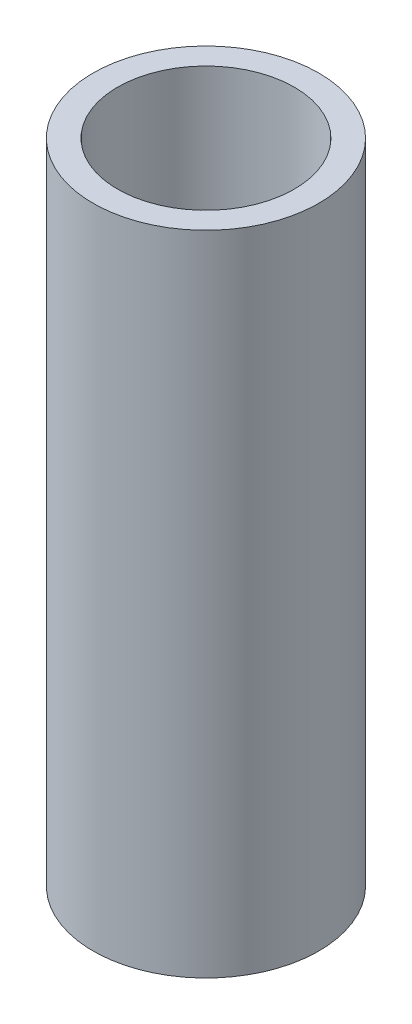
ISO-10303-21;
HEADER;
FILE_DESCRIPTION(('STEP AP214'),'2;1');
FILE_NAME('part.step','',(''),(''),'','','');
FILE_SCHEMA(('AUTOMOTIVE_DESIGN { 1 0 10303 214 1 1 1 1 }'));
ENDSEC;
DATA;
#1=APPLICATION_CONTEXT('core data for automotive mechanical design processes');
#2=APPLICATION_PROTOCOL_DEFINITION('international standard','automotive_design',2000,#1);
#3=PRODUCT_CONTEXT('',#1,'mechanical');
#4=PRODUCT('Part','Part','',(#3));
#5=PRODUCT_RELATED_PRODUCT_CATEGORY('part','',(#4));
#6=PRODUCT_DEFINITION_FORMATION('','',#4);
#7=PRODUCT_DEFINITION_CONTEXT('part definition',#1,'design');
#8=PRODUCT_DEFINITION('design','',#6,#7);
#9=PRODUCT_DEFINITION_SHAPE('','',#8);
#10=(LENGTH_UNIT() NAMED_UNIT(*) SI_UNIT(.MILLI.,.METRE.));
#11=(NAMED_UNIT(*) PLANE_ANGLE_UNIT() SI_UNIT($,.RADIAN.));
#12=(NAMED_UNIT(*) SI_UNIT($,.STERADIAN.) SOLID_ANGLE_UNIT());
#13=UNCERTAINTY_MEASURE_WITH_UNIT(LENGTH_MEASURE(1.E-05),#10,'distance_accuracy_value','');
#14=(GEOMETRIC_REPRESENTATION_CONTEXT(3) GLOBAL_UNCERTAINTY_ASSIGNED_CONTEXT((#13)) GLOBAL_UNIT_ASSIGNED_CONTEXT((#10,
#11,#12)) REPRESENTATION_CONTEXT('',''));
#15=CARTESIAN_POINT('',(0.,0.,0.));
#16=DIRECTION('',(0.,0.,1.));
#17=DIRECTION('',(1.,0.,0.));
#18=AXIS2_PLACEMENT_3D('',#15,#16,#17);
#19=CARTESIAN_POINT('',(0.,172.126797810472,0.));
#20=DIRECTION('',(0.,-1.,0.));
#21=DIRECTION('',(0.,0.,-1.));
#22=AXIS2_PLACEMENT_3D('',#19,#20,#21);
#23=CYLINDRICAL_SURFACE('',#22,30.);
#24=CARTESIAN_POINT('',(0.,172.126797810472,0.));
#25=DIRECTION('',(0.,1.,0.));
#26=DIRECTION('',(0.,0.,1.));
#27=AXIS2_PLACEMENT_3D('',#24,#25,#26);
#28=CIRCLE('',#27,30.);
#29=CARTESIAN_POINT('',(0.,172.126797810472,-30.));
#30=VERTEX_POINT('',#29);
#31=EDGE_CURVE('E10',#30,#30,#28,.T.);
#32=CARTESIAN_POINT('',(0.,0.,0.));
#33=DIRECTION('',(0.,1.,0.));
#34=DIRECTION('',(0.,0.,1.));
#35=AXIS2_PLACEMENT_3D('',#32,#33,#34);
#36=CIRCLE('',#35,30.);
#37=CARTESIAN_POINT('',(0.,0.,-30.));
#38=VERTEX_POINT('',#37);
#39=EDGE_CURVE('E37',#38,#38,#36,.T.);
#40=CARTESIAN_POINT('',(0.,172.126797810472,-30.));
#41=CARTESIAN_POINT('',(0.,170.33381033328,-30.));
#42=CARTESIAN_POINT('',(0.,168.540822856088,-30.));
#43=CARTESIAN_POINT('',(0.,164.954847901703,-30.));
#44=CARTESIAN_POINT('',(0.,163.16186042451,-30.));
#45=CARTESIAN_POINT('',(0.,159.575885470125,-30.));
#46=CARTESIAN_POINT('',(0.,157.782897992933,-30.));
#47=CARTESIAN_POINT('',(0.,154.196923038548,-30.));
#48=CARTESIAN_POINT('',(0.,152.403935561356,-30.));
#49=CARTESIAN_POINT('',(0.,148.817960606971,-30.));
#50=CARTESIAN_POINT('',(0.,147.024973129778,-30.));
#51=CARTESIAN_POINT('',(0.,143.438998175394,-30.));
#52=CARTESIAN_POINT('',(0.,141.646010698201,-30.));
#53=CARTESIAN_POINT('',(0.,138.060035743816,-30.));
#54=CARTESIAN_POINT('',(0.,136.267048266624,-30.));
#55=CARTESIAN_POINT('',(0.,132.681073312239,-30.));
#56=CARTESIAN_POINT('',(0.,130.888085835047,-30.));
#57=CARTESIAN_POINT('',(0.,127.302110880662,-30.));
#58=CARTESIAN_POINT('',(0.,125.509123403469,-30.));
#59=CARTESIAN_POINT('',(0.,121.923148449085,-30.));
#60=CARTESIAN_POINT('',(0.,120.130160971892,-30.));
#61=CARTESIAN_POINT('',(0.,116.544186017507,-30.));
#62=CARTESIAN_POINT('',(0.,114.751198540315,-30.));
#63=CARTESIAN_POINT('',(0.,111.16522358593,-30.));
#64=CARTESIAN_POINT('',(0.,109.372236108738,-30.));
#65=CARTESIAN_POINT('',(0.,105.786261154353,-30.));
#66=CARTESIAN_POINT('',(0.,103.99327367716,-30.));
#67=CARTESIAN_POINT('',(0.,100.407298722776,-30.));
#68=CARTESIAN_POINT('',(0.,98.6143112455831,-30.));
#69=CARTESIAN_POINT('',(0.,95.0283362911983,-30.));
#70=CARTESIAN_POINT('',(0.,93.2353488140059,-30.));
#71=CARTESIAN_POINT('',(0.,89.649373859621,-30.));
#72=CARTESIAN_POINT('',(0.,87.8563863824286,-30.));
#73=CARTESIAN_POINT('',(0.,84.2704114280438,-30.));
#74=CARTESIAN_POINT('',(0.,82.4774239508513,-30.));
#75=CARTESIAN_POINT('',(0.,78.8914489964665,-30.));
#76=CARTESIAN_POINT('',(0.,77.0984615192741,-30.));
#77=CARTESIAN_POINT('',(0.,73.5124865648892,-30.));
#78=CARTESIAN_POINT('',(0.,71.7194990876968,-30.));
#79=CARTESIAN_POINT('',(0.,68.133524133312,-30.));
#80=CARTESIAN_POINT('',(0.,66.3405366561196,-30.));
#81=CARTESIAN_POINT('',(0.,62.7545617017347,-30.));
#82=CARTESIAN_POINT('',(0.,60.9615742245423,-30.));
#83=CARTESIAN_POINT('',(0.,57.3755992701575,-30.));
#84=CARTESIAN_POINT('',(0.,55.582611792965,-30.));
#85=CARTESIAN_POINT('',(0.,51.9966368385802,-30.));
#86=CARTESIAN_POINT('',(0.,50.2036493613878,-30.));
#87=CARTESIAN_POINT('',(0.,46.6176744070029,-30.));
#88=CARTESIAN_POINT('',(0.,44.8246869298105,-30.));
#89=CARTESIAN_POINT('',(0.,41.2387119754257,-30.));
#90=CARTESIAN_POINT('',(0.,39.4457244982332,-30.));
#91=CARTESIAN_POINT('',(0.,35.8597495438484,-30.));
#92=CARTESIAN_POINT('',(0.,34.066762066656,-30.));
#93=CARTESIAN_POINT('',(0.,30.4807871122711,-30.));
#94=CARTESIAN_POINT('',(0.,28.6877996350787,-30.));
#95=CARTESIAN_POINT('',(0.,25.1018246806939,-30.));
#96=CARTESIAN_POINT('',(0.,23.3088372035015,-30.));
#97=CARTESIAN_POINT('',(0.,19.7228622491166,-30.));
#98=CARTESIAN_POINT('',(0.,17.9298747719242,-30.));
#99=CARTESIAN_POINT('',(0.,14.3438998175394,-30.));
#100=CARTESIAN_POINT('',(0.,12.5509123403469,-30.));
#101=CARTESIAN_POINT('',(0.,8.9649373859621,-30.));
#102=CARTESIAN_POINT('',(0.,7.17194990876968,-30.));
#103=CARTESIAN_POINT('',(0.,3.58597495438484,-30.));
#104=CARTESIAN_POINT('',(0.,1.79298747719242,-30.));
#105=CARTESIAN_POINT('',(0.,0.,-30.));
#106=B_SPLINE_CURVE_WITH_KNOTS('',3,(#40,#41,#42,#43,#44,#45,#46,#47,#48,#49,#50,#51,#52,#53,
#54,#55,#56,#57,#58,#59,#60,#61,#62,#63,#64,#65,#66,#67,#68,#69,#70,#71,#72,#73,#74,#75,#76,#77,
#78,#79,#80,#81,#82,#83,#84,#85,#86,#87,#88,#89,#90,#91,#92,#93,#94,#95,#96,#97,#98,#99,#100,
#101,#102,#103,#104,#105),.UNSPECIFIED.,.F.,.F.,(4,2,2,2,2,2,2,2,2,2,2,2,2,2,2,2,2,2,2,2,2,2,2,
2,2,2,2,2,2,2,2,2,4),(0.,5.37896243157726,10.7579248631545,16.1368872947318,21.515849726309,
26.8948121578863,32.2737745894636,37.6527370210408,43.0316994526181,48.4106618841953,
53.7896243157726,59.1685867473499,64.5475491789271,69.9265116105044,75.3054740420816,
80.6844364736589,86.0633989052362,91.4423613368134,96.8213237683907,102.200286199968,
107.579248631545,112.958211063122,118.3371734947,123.716135926277,129.095098357854,
134.474060789432,139.853023221009,145.231985652586,150.610948084163,155.989910515741,
161.368872947318,166.747835378895,172.126797810472),.UNSPECIFIED.);
#107=EDGE_CURVE('BSEAM40',#30,#38,#106,.T.);
#108=ORIENTED_EDGE('',*,*,#31,.F.);
#109=ORIENTED_EDGE('',*,*,#39,.T.);
#110=ORIENTED_EDGE('',*,*,#107,.T.);
#111=ORIENTED_EDGE('',*,*,#107,.F.);
#112=EDGE_LOOP('',(#108,#110,#109,#111));
#113=FACE_BOUND('',#112,.T.);
#114=ADVANCED_FACE('F40',(#113),#23,.T.);
#115=CARTESIAN_POINT('',(0.,172.126797810472,0.));
#116=DIRECTION('',(0.,1.,0.));
#117=DIRECTION('',(0.,0.,1.));
#118=AXIS2_PLACEMENT_3D('',#115,#116,#117);
#119=PLANE('',#118);
#120=CARTESIAN_POINT('',(0.,172.126797810472,0.));
#121=DIRECTION('',(0.,1.,0.));
#122=DIRECTION('',(0.,0.,1.));
#123=AXIS2_PLACEMENT_3D('',#120,#121,#122);
#124=CIRCLE('',#123,23.4951305219697);
#125=CARTESIAN_POINT('',(0.,172.126797810472,-23.4951305219697));
#126=VERTEX_POINT('',#125);
#127=EDGE_CURVE('E50',#126,#126,#124,.T.);
#128=ORIENTED_EDGE('',*,*,#127,.F.);
#129=EDGE_LOOP('',(#128));
#130=FACE_BOUND('',#129,.T.);
#131=ORIENTED_EDGE('',*,*,#31,.T.);
#132=EDGE_LOOP('',(#131));
#133=FACE_BOUND('',#132,.T.);
#134=ADVANCED_FACE('F59',(#130,#133),#119,.T.);
#135=CARTESIAN_POINT('',(0.,0.,0.));
#136=DIRECTION('',(0.,1.,0.));
#137=DIRECTION('',(0.,0.,1.));
#138=AXIS2_PLACEMENT_3D('',#135,#136,#137);
#139=PLANE('',#138);
#140=CARTESIAN_POINT('',(0.,0.,0.));
#141=DIRECTION('',(0.,1.,0.));
#142=DIRECTION('',(0.,0.,1.));
#143=AXIS2_PLACEMENT_3D('',#140,#141,#142);
#144=CIRCLE('',#143,23.4951305219697);
#145=CARTESIAN_POINT('',(0.,0.,-23.4951305219697));
#146=VERTEX_POINT('',#145);
#147=EDGE_CURVE('E47',#146,#146,#144,.T.);
#148=ORIENTED_EDGE('',*,*,#147,.T.);
#149=EDGE_LOOP('',(#148));
#150=FACE_BOUND('',#149,.T.);
#151=ORIENTED_EDGE('',*,*,#39,.F.);
#152=EDGE_LOOP('',(#151));
#153=FACE_BOUND('',#152,.T.);
#154=ADVANCED_FACE('F58',(#150,#153),#139,.F.);
#155=CARTESIAN_POINT('',(0.,172.126797810472,0.));
#156=DIRECTION('',(0.,-1.,0.));
#157=DIRECTION('',(0.,0.,-1.));
#158=AXIS2_PLACEMENT_3D('',#155,#156,#157);
#159=CYLINDRICAL_SURFACE('',#158,23.4951305219697);
#160=CARTESIAN_POINT('',(0.,172.126797810472,-23.4951305219697));
#161=CARTESIAN_POINT('',(0.,170.33381033328,-23.4951305219697));
#162=CARTESIAN_POINT('',(0.,168.540822856088,-23.4951305219697));
#163=CARTESIAN_POINT('',(0.,164.954847901703,-23.4951305219697));
#164=CARTESIAN_POINT('',(0.,163.16186042451,-23.4951305219697));
#165=CARTESIAN_POINT('',(0.,159.575885470125,-23.4951305219697));
#166=CARTESIAN_POINT('',(0.,157.782897992933,-23.4951305219697));
#167=CARTESIAN_POINT('',(0.,154.196923038548,-23.4951305219697));
#168=CARTESIAN_POINT('',(0.,152.403935561356,-23.4951305219697));
#169=CARTESIAN_POINT('',(0.,148.817960606971,-23.4951305219697));
#170=CARTESIAN_POINT('',(0.,147.024973129778,-23.4951305219697));
#171=CARTESIAN_POINT('',(0.,143.438998175394,-23.4951305219697));
#172=CARTESIAN_POINT('',(0.,141.646010698201,-23.4951305219697));
#173=CARTESIAN_POINT('',(0.,138.060035743816,-23.4951305219697));
#174=CARTESIAN_POINT('',(0.,136.267048266624,-23.4951305219697));
#175=CARTESIAN_POINT('',(0.,132.681073312239,-23.4951305219697));
#176=CARTESIAN_POINT('',(0.,130.888085835047,-23.4951305219697));
#177=CARTESIAN_POINT('',(0.,127.302110880662,-23.4951305219697));
#178=CARTESIAN_POINT('',(0.,125.509123403469,-23.4951305219697));
#179=CARTESIAN_POINT('',(0.,121.923148449085,-23.4951305219697));
#180=CARTESIAN_POINT('',(0.,120.130160971892,-23.4951305219697));
#181=CARTESIAN_POINT('',(0.,116.544186017507,-23.4951305219697));
#182=CARTESIAN_POINT('',(0.,114.751198540315,-23.4951305219697));
#183=CARTESIAN_POINT('',(0.,111.16522358593,-23.4951305219697));
#184=CARTESIAN_POINT('',(0.,109.372236108738,-23.4951305219697));
#185=CARTESIAN_POINT('',(0.,105.786261154353,-23.4951305219697));
#186=CARTESIAN_POINT('',(0.,103.99327367716,-23.4951305219697));
#187=CARTESIAN_POINT('',(0.,100.407298722776,-23.4951305219697));
#188=CARTESIAN_POINT('',(0.,98.6143112455831,-23.4951305219697));
#189=CARTESIAN_POINT('',(0.,95.0283362911983,-23.4951305219697));
#190=CARTESIAN_POINT('',(0.,93.2353488140059,-23.4951305219697));
#191=CARTESIAN_POINT('',(0.,89.649373859621,-23.4951305219697));
#192=CARTESIAN_POINT('',(0.,87.8563863824286,-23.4951305219697));
#193=CARTESIAN_POINT('',(0.,84.2704114280438,-23.4951305219697));
#194=CARTESIAN_POINT('',(0.,82.4774239508513,-23.4951305219697));
#195=CARTESIAN_POINT('',(0.,78.8914489964665,-23.4951305219697));
#196=CARTESIAN_POINT('',(0.,77.0984615192741,-23.4951305219697));
#197=CARTESIAN_POINT('',(0.,73.5124865648892,-23.4951305219697));
#198=CARTESIAN_POINT('',(0.,71.7194990876968,-23.4951305219697));
#199=CARTESIAN_POINT('',(0.,68.133524133312,-23.4951305219697));
#200=CARTESIAN_POINT('',(0.,66.3405366561196,-23.4951305219697));
#201=CARTESIAN_POINT('',(0.,62.7545617017347,-23.4951305219697));
#202=CARTESIAN_POINT('',(0.,60.9615742245423,-23.4951305219697));
#203=CARTESIAN_POINT('',(0.,57.3755992701574,-23.4951305219697));
#204=CARTESIAN_POINT('',(0.,55.582611792965,-23.4951305219697));
#205=CARTESIAN_POINT('',(0.,51.9966368385802,-23.4951305219697));
#206=CARTESIAN_POINT('',(0.,50.2036493613878,-23.4951305219697));
#207=CARTESIAN_POINT('',(0.,46.6176744070029,-23.4951305219697));
#208=CARTESIAN_POINT('',(0.,44.8246869298105,-23.4951305219697));
#209=CARTESIAN_POINT('',(0.,41.2387119754257,-23.4951305219697));
#210=CARTESIAN_POINT('',(0.,39.4457244982332,-23.4951305219697));
#211=CARTESIAN_POINT('',(0.,35.8597495438484,-23.4951305219697));
#212=CARTESIAN_POINT('',(0.,34.066762066656,-23.4951305219697));
#213=CARTESIAN_POINT('',(0.,30.4807871122711,-23.4951305219697));
#214=CARTESIAN_POINT('',(0.,28.6877996350787,-23.4951305219697));
#215=CARTESIAN_POINT('',(0.,25.1018246806939,-23.4951305219697));
#216=CARTESIAN_POINT('',(0.,23.3088372035015,-23.4951305219697));
#217=CARTESIAN_POINT('',(0.,19.7228622491166,-23.4951305219697));
#218=CARTESIAN_POINT('',(0.,17.9298747719242,-23.4951305219697));
#219=CARTESIAN_POINT('',(0.,14.3438998175394,-23.4951305219697));
#220=CARTESIAN_POINT('',(0.,12.5509123403469,-23.4951305219697));
#221=CARTESIAN_POINT('',(0.,8.9649373859621,-23.4951305219697));
#222=CARTESIAN_POINT('',(0.,7.17194990876968,-23.4951305219697));
#223=CARTESIAN_POINT('',(0.,3.58597495438484,-23.4951305219697));
#224=CARTESIAN_POINT('',(0.,1.79298747719242,-23.4951305219697));
#225=CARTESIAN_POINT('',(0.,0.,-23.4951305219697));
#226=B_SPLINE_CURVE_WITH_KNOTS('',3,(#160,#161,#162,#163,#164,#165,#166,#167,#168,#169,#170,
#171,#172,#173,#174,#175,#176,#177,#178,#179,#180,#181,#182,#183,#184,#185,#186,#187,#188,#189,
#190,#191,#192,#193,#194,#195,#196,#197,#198,#199,#200,#201,#202,#203,#204,#205,#206,#207,#208,
#209,#210,#211,#212,#213,#214,#215,#216,#217,#218,#219,#220,#221,#222,#223,#224,#225),
.UNSPECIFIED.,.F.,.F.,(4,2,2,2,2,2,2,2,2,2,2,2,2,2,2,2,2,2,2,2,2,2,2,2,2,2,2,2,2,2,2,2,4),(0.,
5.37896243157729,10.7579248631545,16.1368872947318,21.5158497263091,26.8948121578863,
32.2737745894636,37.6527370210409,43.0316994526181,48.4106618841954,53.7896243157726,
59.1685867473499,64.5475491789272,69.9265116105044,75.3054740420817,80.6844364736589,
86.0633989052362,91.4423613368135,96.8213237683907,102.200286199968,107.579248631545,
112.958211063123,118.3371734947,123.716135926277,129.095098357854,134.474060789432,
139.853023221009,145.231985652586,150.610948084163,155.989910515741,161.368872947318,
166.747835378895,172.126797810472),.UNSPECIFIED.);
#227=EDGE_CURVE('BSEAM54',#126,#146,#226,.T.);
#228=ORIENTED_EDGE('',*,*,#127,.T.);
#229=ORIENTED_EDGE('',*,*,#147,.F.);
#230=ORIENTED_EDGE('',*,*,#227,.T.);
#231=ORIENTED_EDGE('',*,*,#227,.F.);
#232=EDGE_LOOP('',(#228,#230,#229,#231));
#233=FACE_BOUND('',#232,.T.);
#234=ADVANCED_FACE('F54',(#233),#159,.F.);
#235=CLOSED_SHELL('',(#114,#134,#154,#234));
#236=MANIFOLD_SOLID_BREP('B2',#235);
#237=ADVANCED_BREP_SHAPE_REPRESENTATION('',(#18,#236),#14);
#238=SHAPE_DEFINITION_REPRESENTATION(#9,#237);
ENDSEC;
END-ISO-10303-21;
